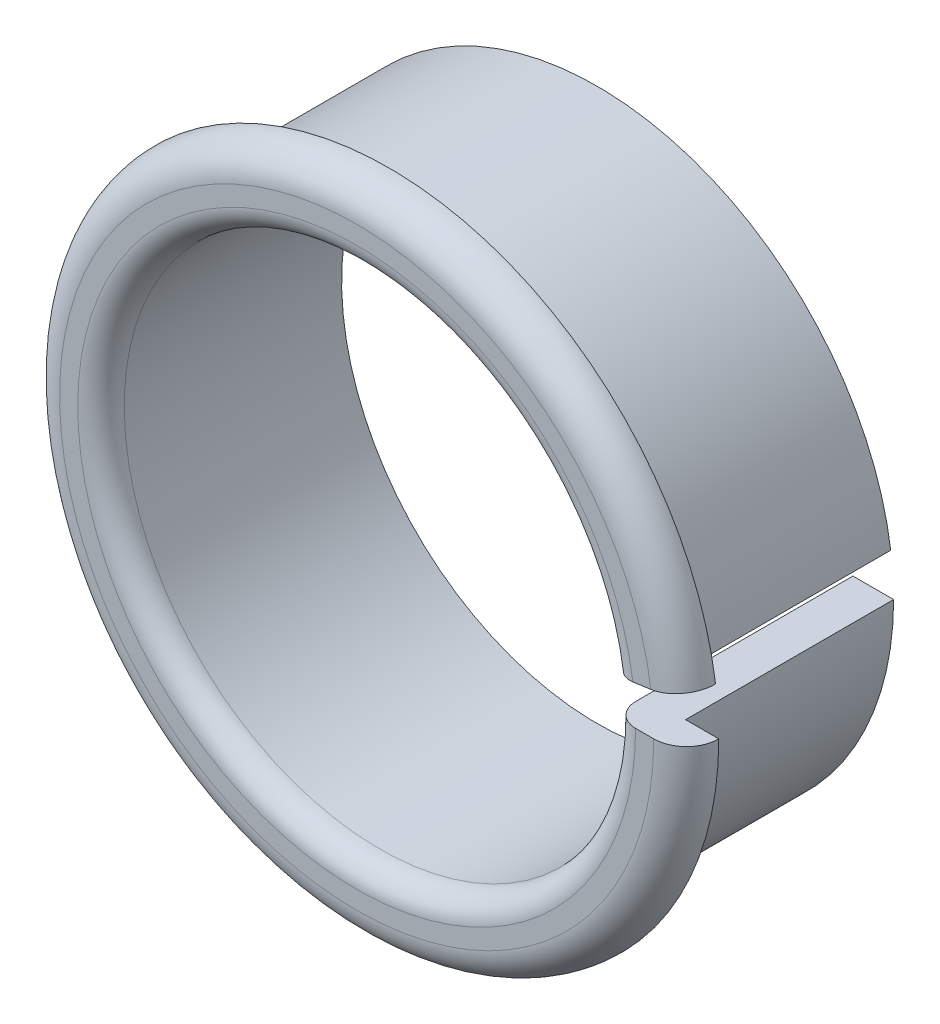
ISO-10303-21;
HEADER;
FILE_DESCRIPTION(('STEP AP214'),'2;1');
FILE_NAME('part.step','',(''),(''),'','','');
FILE_SCHEMA(('AUTOMOTIVE_DESIGN { 1 0 10303 214 1 1 1 1 }'));
ENDSEC;
DATA;
#1=APPLICATION_CONTEXT('core data for automotive mechanical design processes');
#2=APPLICATION_PROTOCOL_DEFINITION('international standard','automotive_design',2000,#1);
#3=PRODUCT_CONTEXT('',#1,'mechanical');
#4=PRODUCT('Part','Part','',(#3));
#5=PRODUCT_RELATED_PRODUCT_CATEGORY('part','',(#4));
#6=PRODUCT_DEFINITION_FORMATION('','',#4);
#7=PRODUCT_DEFINITION_CONTEXT('part definition',#1,'design');
#8=PRODUCT_DEFINITION('design','',#6,#7);
#9=PRODUCT_DEFINITION_SHAPE('','',#8);
#10=(LENGTH_UNIT() NAMED_UNIT(*) SI_UNIT(.MILLI.,.METRE.));
#11=(NAMED_UNIT(*) PLANE_ANGLE_UNIT() SI_UNIT($,.RADIAN.));
#12=(NAMED_UNIT(*) SI_UNIT($,.STERADIAN.) SOLID_ANGLE_UNIT());
#13=UNCERTAINTY_MEASURE_WITH_UNIT(LENGTH_MEASURE(1.E-05),#10,'distance_accuracy_value','');
#14=(GEOMETRIC_REPRESENTATION_CONTEXT(3) GLOBAL_UNCERTAINTY_ASSIGNED_CONTEXT((#13)) GLOBAL_UNIT_ASSIGNED_CONTEXT((#10,
#11,#12)) REPRESENTATION_CONTEXT('',''));
#15=CARTESIAN_POINT('',(0.,0.,0.));
#16=DIRECTION('',(0.,0.,1.));
#17=DIRECTION('',(1.,0.,0.));
#18=AXIS2_PLACEMENT_3D('',#15,#16,#17);
#19=CARTESIAN_POINT('',(10.8929487561573,1.53090411056055,-10.35));
#20=DIRECTION('',(0.,0.,-1.));
#21=DIRECTION('',(-1.,0.,0.));
#22=AXIS2_PLACEMENT_3D('',#19,#20,#21);
#23=PLANE('',#22);
#24=CARTESIAN_POINT('',(0.,0.,-10.35));
#25=DIRECTION('',(0.,0.,1.));
#26=DIRECTION('',(1.,0.,0.));
#27=AXIS2_PLACEMENT_3D('',#24,#25,#26);
#28=CIRCLE('',#27,11.);
#29=CARTESIAN_POINT('',(10.8929487561573,1.53090411056055,-10.35));
#30=VERTEX_POINT('',#29);
#31=CARTESIAN_POINT('',(11.,0.,-10.35));
#32=VERTEX_POINT('',#31);
#33=EDGE_CURVE('E11',#30,#32,#28,.T.);
#34=ORIENTED_EDGE('',*,*,#33,.T.);
#35=DIRECTION('',(-1.,0.,0.));
#36=VECTOR('',#35,1.);
#37=CARTESIAN_POINT('',(11.,0.,-10.35));
#38=LINE('',#37,#36);
#39=CARTESIAN_POINT('',(12.75,0.,-10.35));
#40=VERTEX_POINT('',#39);
#41=EDGE_CURVE('E90',#40,#32,#38,.T.);
#42=ORIENTED_EDGE('',*,*,#41,.F.);
#43=CARTESIAN_POINT('',(0.,0.,-10.35));
#44=DIRECTION('',(0.,0.,1.));
#45=DIRECTION('',(1.,0.,0.));
#46=AXIS2_PLACEMENT_3D('',#43,#44,#45);
#47=CIRCLE('',#46,12.75);
#48=CARTESIAN_POINT('',(12.625917876455,1.77445703724064,-10.35));
#49=VERTEX_POINT('',#48);
#50=EDGE_CURVE('E47',#49,#40,#47,.T.);
#51=ORIENTED_EDGE('',*,*,#50,.F.);
#52=DIRECTION('',(-0.990268068741572,-0.13917310096005,0.));
#53=VECTOR('',#52,1.);
#54=CARTESIAN_POINT('',(10.8929487561573,1.53090411056055,-10.35));
#55=LINE('',#54,#53);
#56=EDGE_CURVE('E92',#49,#30,#55,.T.);
#57=ORIENTED_EDGE('',*,*,#56,.T.);
#58=EDGE_LOOP('',(#34,#42,#51,#57));
#59=FACE_BOUND('',#58,.T.);
#60=ADVANCED_FACE('F32',(#59),#23,.T.);
#61=CARTESIAN_POINT('',(0.,0.,0.));
#62=DIRECTION('',(0.,0.,1.));
#63=DIRECTION('',(1.,0.,0.));
#64=AXIS2_PLACEMENT_3D('',#61,#62,#63);
#65=CYLINDRICAL_SURFACE('',#64,11.);
#66=CARTESIAN_POINT('',(0.,0.,-1.));
#67=DIRECTION('',(0.,0.,1.));
#68=DIRECTION('',(1.,0.,0.));
#69=AXIS2_PLACEMENT_3D('',#66,#67,#68);
#70=CIRCLE('',#69,11.);
#71=CARTESIAN_POINT('',(10.8929487561573,1.53090411056055,-1.));
#72=VERTEX_POINT('',#71);
#73=CARTESIAN_POINT('',(11.,0.,-1.));
#74=VERTEX_POINT('',#73);
#75=EDGE_CURVE('E40',#72,#74,#70,.T.);
#76=ORIENTED_EDGE('',*,*,#75,.T.);
#77=DIRECTION('',(0.,0.,1.));
#78=VECTOR('',#77,1.);
#79=CARTESIAN_POINT('',(11.,0.,-10.35));
#80=LINE('',#79,#78);
#81=EDGE_CURVE('E101',#32,#74,#80,.T.);
#82=ORIENTED_EDGE('',*,*,#81,.F.);
#83=ORIENTED_EDGE('',*,*,#33,.F.);
#84=DIRECTION('',(0.,0.,1.));
#85=VECTOR('',#84,1.);
#86=CARTESIAN_POINT('',(10.8929487561573,1.53090411056055,-10.35));
#87=LINE('',#86,#85);
#88=EDGE_CURVE('E120',#30,#72,#87,.T.);
#89=ORIENTED_EDGE('',*,*,#88,.T.);
#90=EDGE_LOOP('',(#76,#82,#83,#89));
#91=FACE_BOUND('',#90,.T.);
#92=ADVANCED_FACE('F34',(#91),#65,.F.);
#93=CARTESIAN_POINT('',(0.,0.,-1.));
#94=DIRECTION('',(0.,0.,1.));
#95=DIRECTION('',(1.,0.,0.));
#96=AXIS2_PLACEMENT_3D('',#93,#94,#95);
#97=TOROIDAL_SURFACE('',#96,12.,1.);
#98=CARTESIAN_POINT('',(0.,0.,0.));
#99=DIRECTION('',(0.,0.,1.));
#100=DIRECTION('',(1.,0.,0.));
#101=AXIS2_PLACEMENT_3D('',#98,#99,#100);
#102=CIRCLE('',#101,12.);
#103=CARTESIAN_POINT('',(11.8832168248989,1.6700772115206,0.));
#104=VERTEX_POINT('',#103);
#105=CARTESIAN_POINT('',(12.,0.,0.));
#106=VERTEX_POINT('',#105);
#107=EDGE_CURVE('E141',#104,#106,#102,.T.);
#108=ORIENTED_EDGE('',*,*,#107,.T.);
#109=CARTESIAN_POINT('',(12.,0.,-1.));
#110=DIRECTION('',(0.,1.,0.));
#111=DIRECTION('',(0.,0.,1.));
#112=AXIS2_PLACEMENT_3D('',#109,#110,#111);
#113=CIRCLE('',#112,1.);
#114=EDGE_CURVE('E106',#74,#106,#113,.T.);
#115=ORIENTED_EDGE('',*,*,#114,.F.);
#116=ORIENTED_EDGE('',*,*,#75,.F.);
#117=CARTESIAN_POINT('',(11.8832168248989,1.6700772115206,-1.));
#118=DIRECTION('',(-0.13917310096005,0.990268068741572,0.));
#119=DIRECTION('',(0.,0.,1.));
#120=AXIS2_PLACEMENT_3D('',#117,#118,#119);
#121=CIRCLE('',#120,1.);
#122=EDGE_CURVE('E122',#72,#104,#121,.T.);
#123=ORIENTED_EDGE('',*,*,#122,.T.);
#124=EDGE_LOOP('',(#108,#115,#116,#123));
#125=FACE_BOUND('',#124,.T.);
#126=ADVANCED_FACE('F143',(#125),#97,.T.);
#127=CARTESIAN_POINT('',(11.8832168248989,1.6700772115206,0.));
#128=DIRECTION('',(0.,0.,1.));
#129=DIRECTION('',(1.,0.,0.));
#130=AXIS2_PLACEMENT_3D('',#127,#128,#129);
#131=PLANE('',#130);
#132=CARTESIAN_POINT('',(0.,0.,0.));
#133=DIRECTION('',(0.,0.,1.));
#134=DIRECTION('',(1.,0.,0.));
#135=AXIS2_PLACEMENT_3D('',#132,#133,#134);
#136=CIRCLE('',#135,12.7822272046315);
#137=CARTESIAN_POINT('',(12.6578314481464,1.77894219724448,0.));
#138=VERTEX_POINT('',#137);
#139=CARTESIAN_POINT('',(12.7822272046315,0.,0.));
#140=VERTEX_POINT('',#139);
#141=EDGE_CURVE('E139',#138,#140,#136,.T.);
#142=ORIENTED_EDGE('',*,*,#141,.T.);
#143=DIRECTION('',(1.,0.,0.));
#144=VECTOR('',#143,1.);
#145=CARTESIAN_POINT('',(12.,0.,0.));
#146=LINE('',#145,#144);
#147=EDGE_CURVE('E108',#106,#140,#146,.T.);
#148=ORIENTED_EDGE('',*,*,#147,.F.);
#149=ORIENTED_EDGE('',*,*,#107,.F.);
#150=DIRECTION('',(0.990268068741572,0.13917310096005,0.));
#151=VECTOR('',#150,1.);
#152=CARTESIAN_POINT('',(11.8832168248989,1.6700772115206,0.));
#153=LINE('',#152,#151);
#154=EDGE_CURVE('E125',#104,#138,#153,.T.);
#155=ORIENTED_EDGE('',*,*,#154,.T.);
#156=EDGE_LOOP('',(#142,#148,#149,#155));
#157=FACE_BOUND('',#156,.T.);
#158=ADVANCED_FACE('F149',(#157),#131,.T.);
#159=CARTESIAN_POINT('',(0.,0.,-1.39777279536848));
#160=DIRECTION('',(0.,0.,1.));
#161=DIRECTION('',(1.,0.,0.));
#162=AXIS2_PLACEMENT_3D('',#159,#160,#161);
#163=TOROIDAL_SURFACE('',#162,12.7822272046315,1.39777279536848);
#164=CARTESIAN_POINT('',(0.,0.,-1.39777279536848));
#165=DIRECTION('',(0.,0.,1.));
#166=DIRECTION('',(1.,0.,0.));
#167=AXIS2_PLACEMENT_3D('',#164,#165,#166);
#168=CIRCLE('',#167,14.18);
#169=CARTESIAN_POINT('',(14.0420012147555,1.97347457161351,-1.39777279536848));
#170=VERTEX_POINT('',#169);
#171=CARTESIAN_POINT('',(14.18,0.,-1.39777279536848));
#172=VERTEX_POINT('',#171);
#173=EDGE_CURVE('E137',#170,#172,#168,.T.);
#174=ORIENTED_EDGE('',*,*,#173,.T.);
#175=CARTESIAN_POINT('',(12.7822272046315,0.,-1.39777279536848));
#176=DIRECTION('',(0.,1.,0.));
#177=DIRECTION('',(0.,0.,1.));
#178=AXIS2_PLACEMENT_3D('',#175,#176,#177);
#179=CIRCLE('',#178,1.39777279536848);
#180=EDGE_CURVE('E113',#140,#172,#179,.T.);
#181=ORIENTED_EDGE('',*,*,#180,.F.);
#182=ORIENTED_EDGE('',*,*,#141,.F.);
#183=CARTESIAN_POINT('',(12.6578314481464,1.77894219724448,-1.39777279536848));
#184=DIRECTION('',(-0.13917310096005,0.990268068741572,0.));
#185=DIRECTION('',(0.,0.,1.));
#186=AXIS2_PLACEMENT_3D('',#183,#184,#185);
#187=CIRCLE('',#186,1.39777279536848);
#188=EDGE_CURVE('E128',#138,#170,#187,.T.);
#189=ORIENTED_EDGE('',*,*,#188,.T.);
#190=EDGE_LOOP('',(#174,#181,#182,#189));
#191=FACE_BOUND('',#190,.T.);
#192=ADVANCED_FACE('F152',(#191),#163,.T.);
#193=CARTESIAN_POINT('',(12.6259178764551,1.77445703724064,-1.39777279536848));
#194=DIRECTION('',(0.,0.,-1.));
#195=DIRECTION('',(-1.,0.,0.));
#196=AXIS2_PLACEMENT_3D('',#193,#194,#195);
#197=PLANE('',#196);
#198=CARTESIAN_POINT('',(0.,0.,-1.39777279536848));
#199=DIRECTION('',(0.,0.,1.));
#200=DIRECTION('',(1.,0.,0.));
#201=AXIS2_PLACEMENT_3D('',#198,#199,#200);
#202=CIRCLE('',#201,12.75);
#203=CARTESIAN_POINT('',(12.6259178764551,1.77445703724064,-1.39777279536848));
#204=VERTEX_POINT('',#203);
#205=CARTESIAN_POINT('',(12.75,0.,-1.39777279536848));
#206=VERTEX_POINT('',#205);
#207=EDGE_CURVE('E55',#204,#206,#202,.T.);
#208=ORIENTED_EDGE('',*,*,#207,.T.);
#209=DIRECTION('',(-1.,0.,0.));
#210=VECTOR('',#209,1.);
#211=CARTESIAN_POINT('',(12.75,0.,-1.39777279536848));
#212=LINE('',#211,#210);
#213=EDGE_CURVE('E116',#172,#206,#212,.T.);
#214=ORIENTED_EDGE('',*,*,#213,.F.);
#215=ORIENTED_EDGE('',*,*,#173,.F.);
#216=DIRECTION('',(-0.990268068741572,-0.13917310096005,0.));
#217=VECTOR('',#216,1.);
#218=CARTESIAN_POINT('',(12.6259178764551,1.77445703724064,-1.39777279536848));
#219=LINE('',#218,#217);
#220=EDGE_CURVE('E131',#170,#204,#219,.T.);
#221=ORIENTED_EDGE('',*,*,#220,.T.);
#222=EDGE_LOOP('',(#208,#214,#215,#221));
#223=FACE_BOUND('',#222,.T.);
#224=ADVANCED_FACE('F156',(#223),#197,.T.);
#225=CARTESIAN_POINT('',(0.,0.,0.));
#226=DIRECTION('',(0.,0.,1.));
#227=DIRECTION('',(1.,0.,0.));
#228=AXIS2_PLACEMENT_3D('',#225,#226,#227);
#229=CYLINDRICAL_SURFACE('',#228,12.75);
#230=DIRECTION('',(0.,0.,-1.));
#231=VECTOR('',#230,1.);
#232=CARTESIAN_POINT('',(12.625917876455,1.77445703724064,-10.35));
#233=LINE('',#232,#231);
#234=EDGE_CURVE('E133',#204,#49,#233,.T.);
#235=ORIENTED_EDGE('',*,*,#234,.T.);
#236=ORIENTED_EDGE('',*,*,#50,.T.);
#237=DIRECTION('',(0.,0.,-1.));
#238=VECTOR('',#237,1.);
#239=CARTESIAN_POINT('',(12.75,0.,-10.35));
#240=LINE('',#239,#238);
#241=EDGE_CURVE('E104',#206,#40,#240,.T.);
#242=ORIENTED_EDGE('',*,*,#241,.F.);
#243=ORIENTED_EDGE('',*,*,#207,.F.);
#244=EDGE_LOOP('',(#235,#236,#242,#243));
#245=FACE_BOUND('',#244,.T.);
#246=ADVANCED_FACE('F160',(#245),#229,.T.);
#247=CARTESIAN_POINT('',(12.6578314481464,1.77894219724448,-1.39777279536848));
#248=DIRECTION('',(-0.13917310096005,0.990268068741572,0.));
#249=DIRECTION('',(0.,0.,1.));
#250=AXIS2_PLACEMENT_3D('',#247,#248,#249);
#251=PLANE('',#250);
#252=ORIENTED_EDGE('',*,*,#56,.F.);
#253=ORIENTED_EDGE('',*,*,#234,.F.);
#254=ORIENTED_EDGE('',*,*,#220,.F.);
#255=ORIENTED_EDGE('',*,*,#188,.F.);
#256=ORIENTED_EDGE('',*,*,#154,.F.);
#257=ORIENTED_EDGE('',*,*,#122,.F.);
#258=ORIENTED_EDGE('',*,*,#88,.F.);
#259=EDGE_LOOP('',(#252,#253,#254,#255,#256,#257,#258));
#260=FACE_BOUND('',#259,.T.);
#261=ADVANCED_FACE('F159',(#260),#251,.F.);
#262=CARTESIAN_POINT('',(12.7822272046315,0.,-1.39777279536848));
#263=DIRECTION('',(0.,1.,0.));
#264=DIRECTION('',(0.,0.,1.));
#265=AXIS2_PLACEMENT_3D('',#262,#263,#264);
#266=PLANE('',#265);
#267=ORIENTED_EDGE('',*,*,#41,.T.);
#268=ORIENTED_EDGE('',*,*,#81,.T.);
#269=ORIENTED_EDGE('',*,*,#114,.T.);
#270=ORIENTED_EDGE('',*,*,#147,.T.);
#271=ORIENTED_EDGE('',*,*,#180,.T.);
#272=ORIENTED_EDGE('',*,*,#213,.T.);
#273=ORIENTED_EDGE('',*,*,#241,.T.);
#274=EDGE_LOOP('',(#267,#268,#269,#270,#271,#272,#273));
#275=FACE_BOUND('',#274,.T.);
#276=ADVANCED_FACE('F99',(#275),#266,.T.);
#277=CLOSED_SHELL('',(#60,#92,#126,#158,#192,#224,#246,#261,#276));
#278=MANIFOLD_SOLID_BREP('B2',#277);
#279=ADVANCED_BREP_SHAPE_REPRESENTATION('',(#18,#278),#14);
#280=SHAPE_DEFINITION_REPRESENTATION(#9,#279);
ENDSEC;
END-ISO-10303-21;
